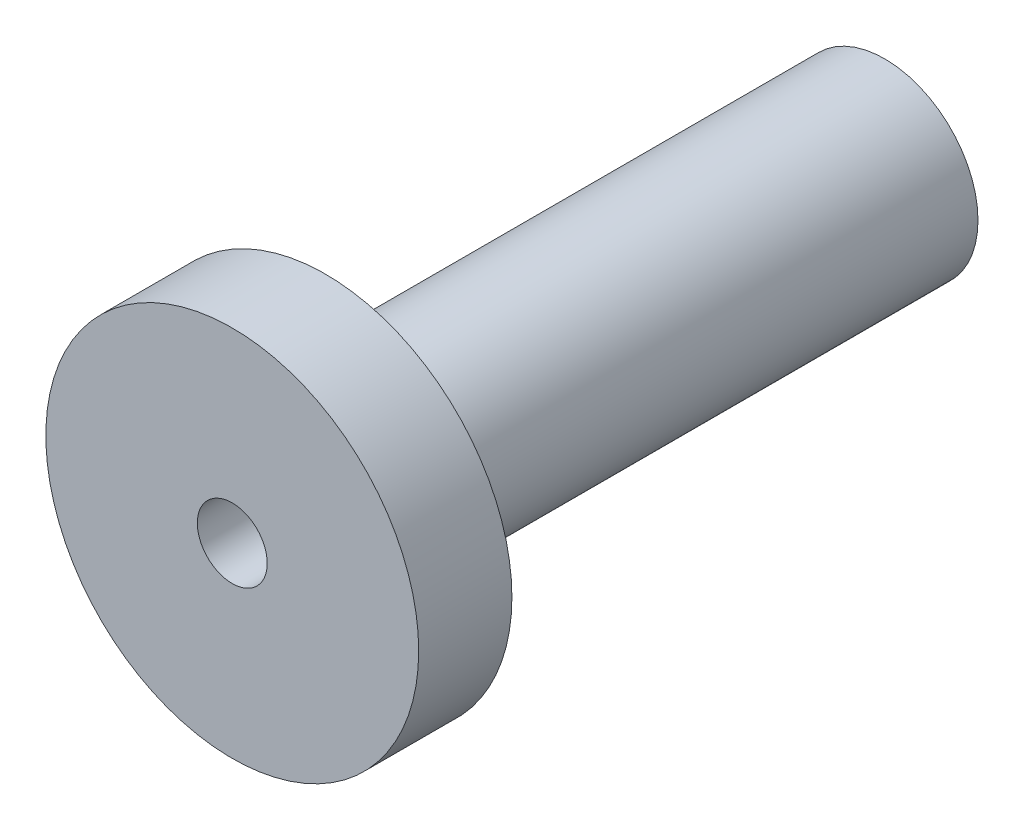
ISO-10303-21;
HEADER;
FILE_DESCRIPTION(('STEP AP214'),'2;1');
FILE_NAME('part.step','',(''),(''),'','','');
FILE_SCHEMA(('AUTOMOTIVE_DESIGN { 1 0 10303 214 1 1 1 1 }'));
ENDSEC;
DATA;
#1=APPLICATION_CONTEXT('core data for automotive mechanical design processes');
#2=APPLICATION_PROTOCOL_DEFINITION('international standard','automotive_design',2000,#1);
#3=PRODUCT_CONTEXT('',#1,'mechanical');
#4=PRODUCT('Part','Part','',(#3));
#5=PRODUCT_RELATED_PRODUCT_CATEGORY('part','',(#4));
#6=PRODUCT_DEFINITION_FORMATION('','',#4);
#7=PRODUCT_DEFINITION_CONTEXT('part definition',#1,'design');
#8=PRODUCT_DEFINITION('design','',#6,#7);
#9=PRODUCT_DEFINITION_SHAPE('','',#8);
#10=(LENGTH_UNIT() NAMED_UNIT(*) SI_UNIT(.MILLI.,.METRE.));
#11=(NAMED_UNIT(*) PLANE_ANGLE_UNIT() SI_UNIT($,.RADIAN.));
#12=(NAMED_UNIT(*) SI_UNIT($,.STERADIAN.) SOLID_ANGLE_UNIT());
#13=UNCERTAINTY_MEASURE_WITH_UNIT(LENGTH_MEASURE(1.E-05),#10,'distance_accuracy_value','');
#14=(GEOMETRIC_REPRESENTATION_CONTEXT(3) GLOBAL_UNCERTAINTY_ASSIGNED_CONTEXT((#13)) GLOBAL_UNIT_ASSIGNED_CONTEXT((#10,
#11,#12)) REPRESENTATION_CONTEXT('',''));
#15=CARTESIAN_POINT('',(0.,0.,0.));
#16=DIRECTION('',(0.,0.,1.));
#17=DIRECTION('',(1.,0.,0.));
#18=AXIS2_PLACEMENT_3D('',#15,#16,#17);
#19=CARTESIAN_POINT('',(0.,-4.,0.));
#20=DIRECTION('',(0.,0.,1.));
#21=DIRECTION('',(1.,0.,0.));
#22=AXIS2_PLACEMENT_3D('',#19,#20,#21);
#23=PLANE('',#22);
#24=CARTESIAN_POINT('',(0.,0.,0.));
#25=DIRECTION('',(0.,0.,-1.));
#26=DIRECTION('',(-1.,0.,0.));
#27=AXIS2_PLACEMENT_3D('',#24,#25,#26);
#28=CIRCLE('',#27,0.75);
#29=CARTESIAN_POINT('',(-0.75,0.,0.));
#30=VERTEX_POINT('',#29);
#31=EDGE_CURVE('E64',#30,#30,#28,.T.);
#32=ORIENTED_EDGE('',*,*,#31,.T.);
#33=EDGE_LOOP('',(#32));
#34=FACE_BOUND('',#33,.T.);
#35=CARTESIAN_POINT('',(0.,0.,0.));
#36=DIRECTION('',(0.,0.,1.));
#37=DIRECTION('',(1.,0.,0.));
#38=AXIS2_PLACEMENT_3D('',#35,#36,#37);
#39=CIRCLE('',#38,4.);
#40=CARTESIAN_POINT('',(4.,0.,0.));
#41=VERTEX_POINT('',#40);
#42=EDGE_CURVE('E58',#41,#41,#39,.T.);
#43=ORIENTED_EDGE('',*,*,#42,.T.);
#44=EDGE_LOOP('',(#43));
#45=FACE_BOUND('',#44,.T.);
#46=ADVANCED_FACE('F41',(#34,#45),#23,.T.);
#47=CARTESIAN_POINT('',(0.,0.,-14.));
#48=DIRECTION('',(0.,0.,-1.));
#49=DIRECTION('',(-1.,0.,0.));
#50=AXIS2_PLACEMENT_3D('',#47,#48,#49);
#51=PLANE('',#50);
#52=CARTESIAN_POINT('',(0.,0.,-14.));
#53=DIRECTION('',(0.,0.,-1.));
#54=DIRECTION('',(-1.,0.,0.));
#55=AXIS2_PLACEMENT_3D('',#52,#53,#54);
#56=CIRCLE('',#55,0.75);
#57=CARTESIAN_POINT('',(-0.75,0.,-14.));
#58=VERTEX_POINT('',#57);
#59=EDGE_CURVE('E65',#58,#58,#56,.T.);
#60=ORIENTED_EDGE('',*,*,#59,.F.);
#61=EDGE_LOOP('',(#60));
#62=FACE_BOUND('',#61,.T.);
#63=CARTESIAN_POINT('',(0.,0.,-14.));
#64=DIRECTION('',(0.,0.,1.));
#65=DIRECTION('',(1.,0.,0.));
#66=AXIS2_PLACEMENT_3D('',#63,#64,#65);
#67=CIRCLE('',#66,2.);
#68=CARTESIAN_POINT('',(2.,0.,-14.));
#69=VERTEX_POINT('',#68);
#70=EDGE_CURVE('E10',#69,#69,#67,.T.);
#71=ORIENTED_EDGE('',*,*,#70,.F.);
#72=EDGE_LOOP('',(#71));
#73=FACE_BOUND('',#72,.T.);
#74=ADVANCED_FACE('F82',(#62,#73),#51,.T.);
#75=CARTESIAN_POINT('',(0.,0.,0.));
#76=DIRECTION('',(0.,0.,1.));
#77=DIRECTION('',(1.,0.,0.));
#78=AXIS2_PLACEMENT_3D('',#75,#76,#77);
#79=CYLINDRICAL_SURFACE('',#78,2.);
#80=ORIENTED_EDGE('',*,*,#70,.T.);
#81=EDGE_LOOP('',(#80));
#82=FACE_BOUND('',#81,.T.);
#83=CARTESIAN_POINT('',(0.,0.,-2.));
#84=DIRECTION('',(0.,0.,1.));
#85=DIRECTION('',(1.,0.,0.));
#86=AXIS2_PLACEMENT_3D('',#83,#84,#85);
#87=CIRCLE('',#86,2.);
#88=CARTESIAN_POINT('',(2.,0.,-2.));
#89=VERTEX_POINT('',#88);
#90=EDGE_CURVE('E48',#89,#89,#87,.T.);
#91=ORIENTED_EDGE('',*,*,#90,.F.);
#92=EDGE_LOOP('',(#91));
#93=FACE_BOUND('',#92,.T.);
#94=ADVANCED_FACE('F85',(#82,#93),#79,.T.);
#95=CARTESIAN_POINT('',(0.,-2.,-2.));
#96=DIRECTION('',(0.,0.,-1.));
#97=DIRECTION('',(-1.,0.,0.));
#98=AXIS2_PLACEMENT_3D('',#95,#96,#97);
#99=PLANE('',#98);
#100=ORIENTED_EDGE('',*,*,#90,.T.);
#101=EDGE_LOOP('',(#100));
#102=FACE_BOUND('',#101,.T.);
#103=CARTESIAN_POINT('',(0.,0.,-2.));
#104=DIRECTION('',(0.,0.,1.));
#105=DIRECTION('',(1.,0.,0.));
#106=AXIS2_PLACEMENT_3D('',#103,#104,#105);
#107=CIRCLE('',#106,4.);
#108=CARTESIAN_POINT('',(4.,0.,-2.));
#109=VERTEX_POINT('',#108);
#110=EDGE_CURVE('E53',#109,#109,#107,.T.);
#111=ORIENTED_EDGE('',*,*,#110,.F.);
#112=EDGE_LOOP('',(#111));
#113=FACE_BOUND('',#112,.T.);
#114=ADVANCED_FACE('F90',(#102,#113),#99,.T.);
#115=CARTESIAN_POINT('',(0.,0.,0.));
#116=DIRECTION('',(0.,0.,1.));
#117=DIRECTION('',(1.,0.,0.));
#118=AXIS2_PLACEMENT_3D('',#115,#116,#117);
#119=CYLINDRICAL_SURFACE('',#118,4.);
#120=ORIENTED_EDGE('',*,*,#110,.T.);
#121=EDGE_LOOP('',(#120));
#122=FACE_BOUND('',#121,.T.);
#123=ORIENTED_EDGE('',*,*,#42,.F.);
#124=EDGE_LOOP('',(#123));
#125=FACE_BOUND('',#124,.T.);
#126=ADVANCED_FACE('F78',(#122,#125),#119,.T.);
#127=CARTESIAN_POINT('',(0.,0.,0.));
#128=DIRECTION('',(0.,0.,-1.));
#129=DIRECTION('',(-1.,0.,0.));
#130=AXIS2_PLACEMENT_3D('',#127,#128,#129);
#131=CYLINDRICAL_SURFACE('',#130,0.75);
#132=ORIENTED_EDGE('',*,*,#31,.F.);
#133=EDGE_LOOP('',(#132));
#134=FACE_BOUND('',#133,.T.);
#135=ORIENTED_EDGE('',*,*,#59,.T.);
#136=EDGE_LOOP('',(#135));
#137=FACE_BOUND('',#136,.T.);
#138=ADVANCED_FACE('F75',(#134,#137),#131,.F.);
#139=CLOSED_SHELL('',(#46,#74,#94,#114,#126,#138));
#140=MANIFOLD_SOLID_BREP('B2',#139);
#141=ADVANCED_BREP_SHAPE_REPRESENTATION('',(#18,#140),#14);
#142=SHAPE_DEFINITION_REPRESENTATION(#9,#141);
ENDSEC;
END-ISO-10303-21;
